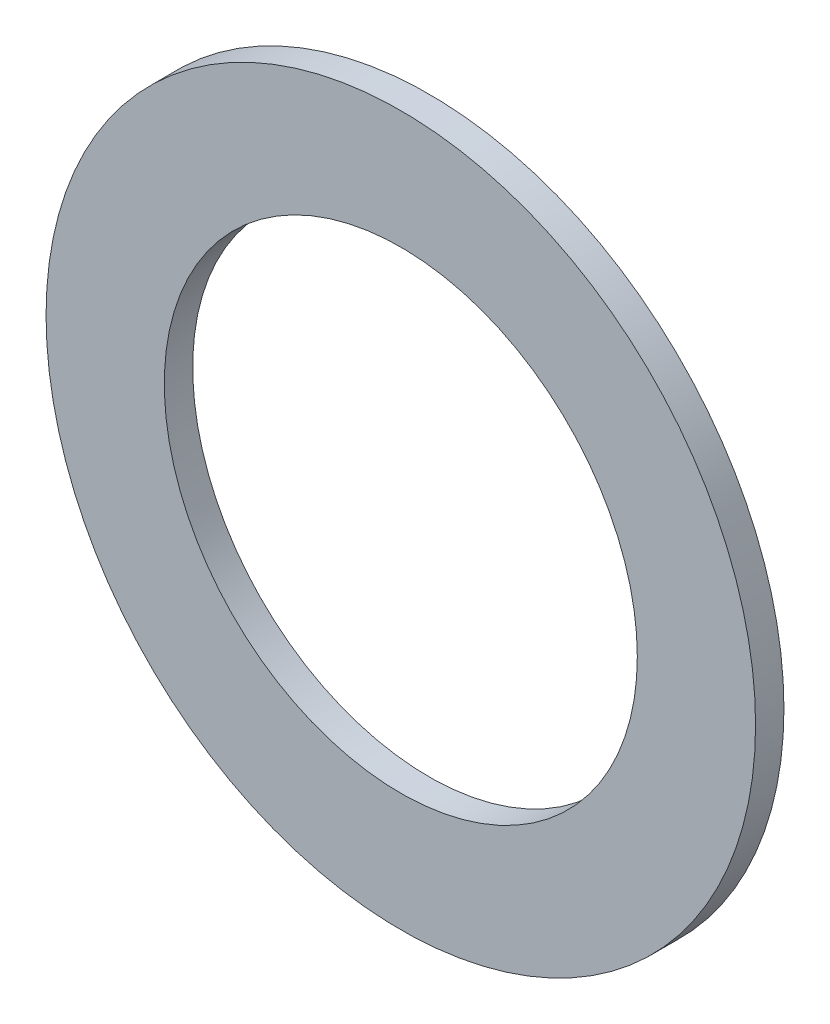
ISO-10303-21;
HEADER;
FILE_DESCRIPTION(('STEP AP214'),'2;1');
FILE_NAME('part.step','',(''),(''),'','','');
FILE_SCHEMA(('AUTOMOTIVE_DESIGN { 1 0 10303 214 1 1 1 1 }'));
ENDSEC;
DATA;
#1=APPLICATION_CONTEXT('core data for automotive mechanical design processes');
#2=APPLICATION_PROTOCOL_DEFINITION('international standard','automotive_design',2000,#1);
#3=PRODUCT_CONTEXT('',#1,'mechanical');
#4=PRODUCT('Part','Part','',(#3));
#5=PRODUCT_RELATED_PRODUCT_CATEGORY('part','',(#4));
#6=PRODUCT_DEFINITION_FORMATION('','',#4);
#7=PRODUCT_DEFINITION_CONTEXT('part definition',#1,'design');
#8=PRODUCT_DEFINITION('design','',#6,#7);
#9=PRODUCT_DEFINITION_SHAPE('','',#8);
#10=(LENGTH_UNIT() NAMED_UNIT(*) SI_UNIT(.MILLI.,.METRE.));
#11=(NAMED_UNIT(*) PLANE_ANGLE_UNIT() SI_UNIT($,.RADIAN.));
#12=(NAMED_UNIT(*) SI_UNIT($,.STERADIAN.) SOLID_ANGLE_UNIT());
#13=UNCERTAINTY_MEASURE_WITH_UNIT(LENGTH_MEASURE(1.E-05),#10,'distance_accuracy_value','');
#14=(GEOMETRIC_REPRESENTATION_CONTEXT(3) GLOBAL_UNCERTAINTY_ASSIGNED_CONTEXT((#13)) GLOBAL_UNIT_ASSIGNED_CONTEXT((#10,
#11,#12)) REPRESENTATION_CONTEXT('',''));
#15=CARTESIAN_POINT('',(0.,0.,0.));
#16=DIRECTION('',(0.,0.,1.));
#17=DIRECTION('',(1.,0.,0.));
#18=AXIS2_PLACEMENT_3D('',#15,#16,#17);
#19=CARTESIAN_POINT('',(0.,0.,0.762));
#20=DIRECTION('',(0.,0.,1.));
#21=DIRECTION('',(1.,0.,0.));
#22=AXIS2_PLACEMENT_3D('',#19,#20,#21);
#23=PLANE('',#22);
#24=CARTESIAN_POINT('',(0.,0.,0.762));
#25=DIRECTION('',(0.,0.,1.));
#26=DIRECTION('',(1.,0.,0.));
#27=AXIS2_PLACEMENT_3D('',#24,#25,#26);
#28=CIRCLE('',#27,9.525);
#29=CARTESIAN_POINT('',(9.525,0.,0.762));
#30=VERTEX_POINT('',#29);
#31=EDGE_CURVE('E10',#30,#30,#28,.T.);
#32=ORIENTED_EDGE('',*,*,#31,.T.);
#33=EDGE_LOOP('',(#32));
#34=FACE_BOUND('',#33,.T.);
#35=CARTESIAN_POINT('',(0.,0.,0.762));
#36=DIRECTION('',(0.,0.,1.));
#37=DIRECTION('',(1.,0.,0.));
#38=AXIS2_PLACEMENT_3D('',#35,#36,#37);
#39=CIRCLE('',#38,6.35);
#40=CARTESIAN_POINT('',(6.35,0.,0.762));
#41=VERTEX_POINT('',#40);
#42=EDGE_CURVE('E42',#41,#41,#39,.T.);
#43=ORIENTED_EDGE('',*,*,#42,.F.);
#44=EDGE_LOOP('',(#43));
#45=FACE_BOUND('',#44,.T.);
#46=ADVANCED_FACE('F31',(#34,#45),#23,.T.);
#47=CARTESIAN_POINT('',(0.,0.,0.));
#48=DIRECTION('',(0.,0.,1.));
#49=DIRECTION('',(1.,0.,0.));
#50=AXIS2_PLACEMENT_3D('',#47,#48,#49);
#51=PLANE('',#50);
#52=CARTESIAN_POINT('',(0.,0.,0.));
#53=DIRECTION('',(0.,0.,1.));
#54=DIRECTION('',(1.,0.,0.));
#55=AXIS2_PLACEMENT_3D('',#52,#53,#54);
#56=CIRCLE('',#55,9.525);
#57=CARTESIAN_POINT('',(9.525,0.,0.));
#58=VERTEX_POINT('',#57);
#59=EDGE_CURVE('E35',#58,#58,#56,.T.);
#60=ORIENTED_EDGE('',*,*,#59,.F.);
#61=EDGE_LOOP('',(#60));
#62=FACE_BOUND('',#61,.T.);
#63=CARTESIAN_POINT('',(0.,0.,0.));
#64=DIRECTION('',(0.,0.,1.));
#65=DIRECTION('',(1.,0.,0.));
#66=AXIS2_PLACEMENT_3D('',#63,#64,#65);
#67=CIRCLE('',#66,6.35);
#68=CARTESIAN_POINT('',(6.35,0.,0.));
#69=VERTEX_POINT('',#68);
#70=EDGE_CURVE('E44',#69,#69,#67,.T.);
#71=ORIENTED_EDGE('',*,*,#70,.T.);
#72=EDGE_LOOP('',(#71));
#73=FACE_BOUND('',#72,.T.);
#74=ADVANCED_FACE('F54',(#62,#73),#51,.F.);
#75=CARTESIAN_POINT('',(0.,0.,0.762));
#76=DIRECTION('',(0.,0.,-1.));
#77=DIRECTION('',(-1.,0.,0.));
#78=AXIS2_PLACEMENT_3D('',#75,#76,#77);
#79=CYLINDRICAL_SURFACE('',#78,9.525);
#80=ORIENTED_EDGE('',*,*,#31,.F.);
#81=EDGE_LOOP('',(#80));
#82=FACE_BOUND('',#81,.T.);
#83=ORIENTED_EDGE('',*,*,#59,.T.);
#84=EDGE_LOOP('',(#83));
#85=FACE_BOUND('',#84,.T.);
#86=ADVANCED_FACE('F33',(#82,#85),#79,.T.);
#87=CARTESIAN_POINT('',(0.,0.,0.762));
#88=DIRECTION('',(0.,0.,-1.));
#89=DIRECTION('',(-1.,0.,0.));
#90=AXIS2_PLACEMENT_3D('',#87,#88,#89);
#91=CYLINDRICAL_SURFACE('',#90,6.35);
#92=ORIENTED_EDGE('',*,*,#42,.T.);
#93=EDGE_LOOP('',(#92));
#94=FACE_BOUND('',#93,.T.);
#95=ORIENTED_EDGE('',*,*,#70,.F.);
#96=EDGE_LOOP('',(#95));
#97=FACE_BOUND('',#96,.T.);
#98=ADVANCED_FACE('F50',(#94,#97),#91,.F.);
#99=CLOSED_SHELL('',(#46,#74,#86,#98));
#100=MANIFOLD_SOLID_BREP('B2',#99);
#101=ADVANCED_BREP_SHAPE_REPRESENTATION('',(#18,#100),#14);
#102=SHAPE_DEFINITION_REPRESENTATION(#9,#101);
ENDSEC;
END-ISO-10303-21;
